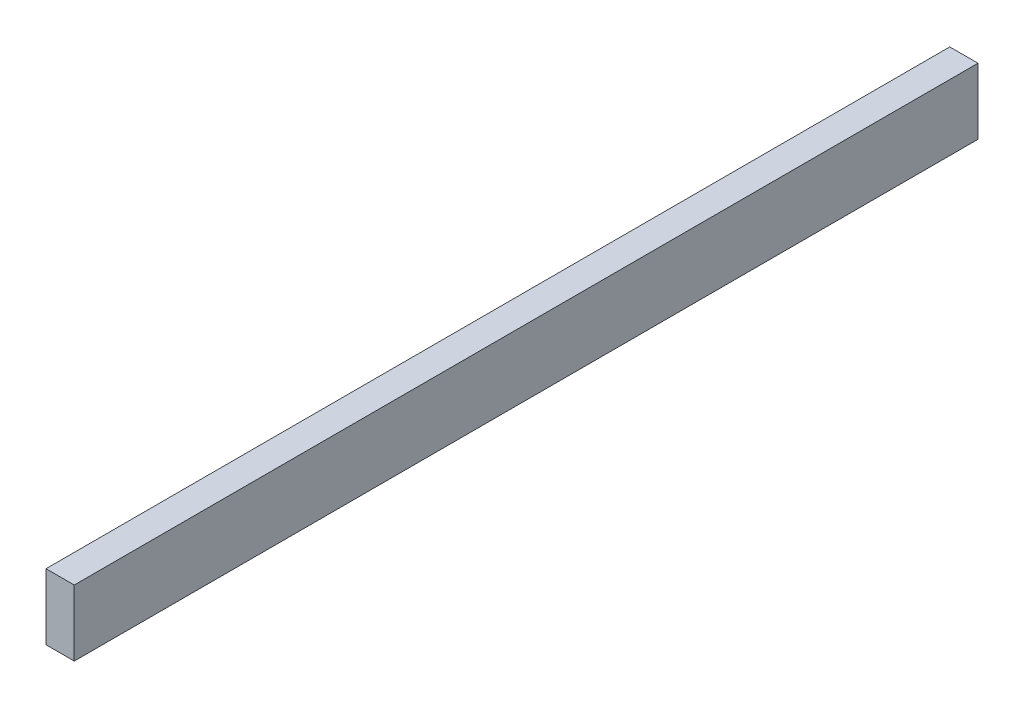
ISO-10303-21;
HEADER;
FILE_DESCRIPTION(('STEP AP214'),'2;1');
FILE_NAME('part.step','',(''),(''),'','','');
FILE_SCHEMA(('AUTOMOTIVE_DESIGN { 1 0 10303 214 1 1 1 1 }'));
ENDSEC;
DATA;
#1=APPLICATION_CONTEXT('core data for automotive mechanical design processes');
#2=APPLICATION_PROTOCOL_DEFINITION('international standard','automotive_design',2000,#1);
#3=PRODUCT_CONTEXT('',#1,'mechanical');
#4=PRODUCT('Part','Part','',(#3));
#5=PRODUCT_RELATED_PRODUCT_CATEGORY('part','',(#4));
#6=PRODUCT_DEFINITION_FORMATION('','',#4);
#7=PRODUCT_DEFINITION_CONTEXT('part definition',#1,'design');
#8=PRODUCT_DEFINITION('design','',#6,#7);
#9=PRODUCT_DEFINITION_SHAPE('','',#8);
#10=(LENGTH_UNIT() NAMED_UNIT(*) SI_UNIT(.MILLI.,.METRE.));
#11=(NAMED_UNIT(*) PLANE_ANGLE_UNIT() SI_UNIT($,.RADIAN.));
#12=(NAMED_UNIT(*) SI_UNIT($,.STERADIAN.) SOLID_ANGLE_UNIT());
#13=UNCERTAINTY_MEASURE_WITH_UNIT(LENGTH_MEASURE(1.E-05),#10,'distance_accuracy_value','');
#14=(GEOMETRIC_REPRESENTATION_CONTEXT(3) GLOBAL_UNCERTAINTY_ASSIGNED_CONTEXT((#13)) GLOBAL_UNIT_ASSIGNED_CONTEXT((#10,
#11,#12)) REPRESENTATION_CONTEXT('',''));
#15=CARTESIAN_POINT('',(0.,0.,0.));
#16=DIRECTION('',(0.,0.,1.));
#17=DIRECTION('',(1.,0.,0.));
#18=AXIS2_PLACEMENT_3D('',#15,#16,#17);
#19=CARTESIAN_POINT('',(-38.1,51.2664467451988,1219.2));
#20=DIRECTION('',(1.,0.,0.));
#21=DIRECTION('',(0.,1.,0.));
#22=AXIS2_PLACEMENT_3D('',#19,#20,#21);
#23=PLANE('',#22);
#24=DIRECTION('',(0.,-1.,0.));
#25=VECTOR('',#24,1.);
#26=CARTESIAN_POINT('',(-38.1,51.2664467451988,0.));
#27=LINE('',#26,#25);
#28=CARTESIAN_POINT('',(-38.1,51.2664467451988,0.));
#29=VERTEX_POINT('',#28);
#30=CARTESIAN_POINT('',(-38.1,-37.6335532548011,0.));
#31=VERTEX_POINT('',#30);
#32=EDGE_CURVE('E95',#29,#31,#27,.T.);
#33=ORIENTED_EDGE('',*,*,#32,.T.);
#34=DIRECTION('',(0.,0.,-1.));
#35=VECTOR('',#34,1.);
#36=CARTESIAN_POINT('',(-38.1,-37.6335532548011,1219.2));
#37=LINE('',#36,#35);
#38=CARTESIAN_POINT('',(-38.1,-37.6335532548011,1219.2));
#39=VERTEX_POINT('',#38);
#40=EDGE_CURVE('E11',#39,#31,#37,.T.);
#41=ORIENTED_EDGE('',*,*,#40,.F.);
#42=DIRECTION('',(0.,-1.,0.));
#43=VECTOR('',#42,1.);
#44=CARTESIAN_POINT('',(-38.1,51.2664467451988,1219.2));
#45=LINE('',#44,#43);
#46=CARTESIAN_POINT('',(-38.1,51.2664467451988,1219.2));
#47=VERTEX_POINT('',#46);
#48=EDGE_CURVE('E83',#47,#39,#45,.T.);
#49=ORIENTED_EDGE('',*,*,#48,.F.);
#50=DIRECTION('',(0.,0.,-1.));
#51=VECTOR('',#50,1.);
#52=CARTESIAN_POINT('',(-38.1,51.2664467451988,1219.2));
#53=LINE('',#52,#51);
#54=EDGE_CURVE('E91',#47,#29,#53,.T.);
#55=ORIENTED_EDGE('',*,*,#54,.T.);
#56=EDGE_LOOP('',(#33,#41,#49,#55));
#57=FACE_BOUND('',#56,.T.);
#58=ADVANCED_FACE('F32',(#57),#23,.F.);
#59=CARTESIAN_POINT('',(-38.1,-37.6335532548011,1219.2));
#60=DIRECTION('',(0.,1.,0.));
#61=DIRECTION('',(0.,0.,1.));
#62=AXIS2_PLACEMENT_3D('',#59,#60,#61);
#63=PLANE('',#62);
#64=DIRECTION('',(1.,0.,0.));
#65=VECTOR('',#64,1.);
#66=CARTESIAN_POINT('',(-38.1,-37.6335532548011,0.));
#67=LINE('',#66,#65);
#68=CARTESIAN_POINT('',(0.,-37.6335532548011,0.));
#69=VERTEX_POINT('',#68);
#70=EDGE_CURVE('E87',#31,#69,#67,.T.);
#71=ORIENTED_EDGE('',*,*,#70,.T.);
#72=DIRECTION('',(0.,0.,-1.));
#73=VECTOR('',#72,1.);
#74=CARTESIAN_POINT('',(0.,-37.6335532548011,1219.2));
#75=LINE('',#74,#73);
#76=CARTESIAN_POINT('',(0.,-37.6335532548011,1219.2));
#77=VERTEX_POINT('',#76);
#78=EDGE_CURVE('E40',#77,#69,#75,.T.);
#79=ORIENTED_EDGE('',*,*,#78,.F.);
#80=DIRECTION('',(1.,0.,0.));
#81=VECTOR('',#80,1.);
#82=CARTESIAN_POINT('',(-38.1,-37.6335532548011,1219.2));
#83=LINE('',#82,#81);
#84=EDGE_CURVE('E78',#39,#77,#83,.T.);
#85=ORIENTED_EDGE('',*,*,#84,.F.);
#86=ORIENTED_EDGE('',*,*,#40,.T.);
#87=EDGE_LOOP('',(#71,#79,#85,#86));
#88=FACE_BOUND('',#87,.T.);
#89=ADVANCED_FACE('F86',(#88),#63,.F.);
#90=CARTESIAN_POINT('',(0.,51.2664467451988,1219.2));
#91=DIRECTION('',(-1.,0.,0.));
#92=DIRECTION('',(0.,0.,1.));
#93=AXIS2_PLACEMENT_3D('',#90,#91,#92);
#94=PLANE('',#93);
#95=DIRECTION('',(0.,1.,0.));
#96=VECTOR('',#95,1.);
#97=CARTESIAN_POINT('',(0.,51.2664467451988,0.));
#98=LINE('',#97,#96);
#99=CARTESIAN_POINT('',(0.,51.2664467451988,0.));
#100=VERTEX_POINT('',#99);
#101=EDGE_CURVE('E65',#69,#100,#98,.T.);
#102=ORIENTED_EDGE('',*,*,#101,.T.);
#103=DIRECTION('',(0.,0.,-1.));
#104=VECTOR('',#103,1.);
#105=CARTESIAN_POINT('',(0.,51.2664467451988,1219.2));
#106=LINE('',#105,#104);
#107=CARTESIAN_POINT('',(0.,51.2664467451988,1219.2));
#108=VERTEX_POINT('',#107);
#109=EDGE_CURVE('E88',#108,#100,#106,.T.);
#110=ORIENTED_EDGE('',*,*,#109,.F.);
#111=DIRECTION('',(0.,1.,0.));
#112=VECTOR('',#111,1.);
#113=CARTESIAN_POINT('',(0.,51.2664467451988,1219.2));
#114=LINE('',#113,#112);
#115=EDGE_CURVE('E81',#77,#108,#114,.T.);
#116=ORIENTED_EDGE('',*,*,#115,.F.);
#117=ORIENTED_EDGE('',*,*,#78,.T.);
#118=EDGE_LOOP('',(#102,#110,#116,#117));
#119=FACE_BOUND('',#118,.T.);
#120=ADVANCED_FACE('F89',(#119),#94,.F.);
#121=CARTESIAN_POINT('',(-38.1,51.2664467451988,1219.2));
#122=DIRECTION('',(0.,-1.,0.));
#123=DIRECTION('',(0.,0.,-1.));
#124=AXIS2_PLACEMENT_3D('',#121,#122,#123);
#125=PLANE('',#124);
#126=DIRECTION('',(-1.,0.,0.));
#127=VECTOR('',#126,1.);
#128=CARTESIAN_POINT('',(-38.1,51.2664467451988,0.));
#129=LINE('',#128,#127);
#130=EDGE_CURVE('E71',#100,#29,#129,.T.);
#131=ORIENTED_EDGE('',*,*,#130,.T.);
#132=ORIENTED_EDGE('',*,*,#54,.F.);
#133=DIRECTION('',(-1.,0.,0.));
#134=VECTOR('',#133,1.);
#135=CARTESIAN_POINT('',(-38.1,51.2664467451988,1219.2));
#136=LINE('',#135,#134);
#137=EDGE_CURVE('E48',#108,#47,#136,.T.);
#138=ORIENTED_EDGE('',*,*,#137,.F.);
#139=ORIENTED_EDGE('',*,*,#109,.T.);
#140=EDGE_LOOP('',(#131,#132,#138,#139));
#141=FACE_BOUND('',#140,.T.);
#142=ADVANCED_FACE('F102',(#141),#125,.F.);
#143=CARTESIAN_POINT('',(0.,0.,1219.2));
#144=DIRECTION('',(0.,0.,1.));
#145=DIRECTION('',(1.,0.,0.));
#146=AXIS2_PLACEMENT_3D('',#143,#144,#145);
#147=PLANE('',#146);
#148=ORIENTED_EDGE('',*,*,#48,.T.);
#149=ORIENTED_EDGE('',*,*,#84,.T.);
#150=ORIENTED_EDGE('',*,*,#115,.T.);
#151=ORIENTED_EDGE('',*,*,#137,.T.);
#152=EDGE_LOOP('',(#148,#149,#150,#151));
#153=FACE_BOUND('',#152,.T.);
#154=ADVANCED_FACE('F79',(#153),#147,.T.);
#155=CARTESIAN_POINT('',(0.,0.,0.));
#156=DIRECTION('',(0.,0.,1.));
#157=DIRECTION('',(1.,0.,0.));
#158=AXIS2_PLACEMENT_3D('',#155,#156,#157);
#159=PLANE('',#158);
#160=ORIENTED_EDGE('',*,*,#32,.F.);
#161=ORIENTED_EDGE('',*,*,#130,.F.);
#162=ORIENTED_EDGE('',*,*,#101,.F.);
#163=ORIENTED_EDGE('',*,*,#70,.F.);
#164=EDGE_LOOP('',(#160,#161,#162,#163));
#165=FACE_BOUND('',#164,.T.);
#166=ADVANCED_FACE('F105',(#165),#159,.F.);
#167=CLOSED_SHELL('',(#58,#89,#120,#142,#154,#166));
#168=MANIFOLD_SOLID_BREP('B2',#167);
#169=ADVANCED_BREP_SHAPE_REPRESENTATION('',(#18,#168),#14);
#170=SHAPE_DEFINITION_REPRESENTATION(#9,#169);
ENDSEC;
END-ISO-10303-21;
